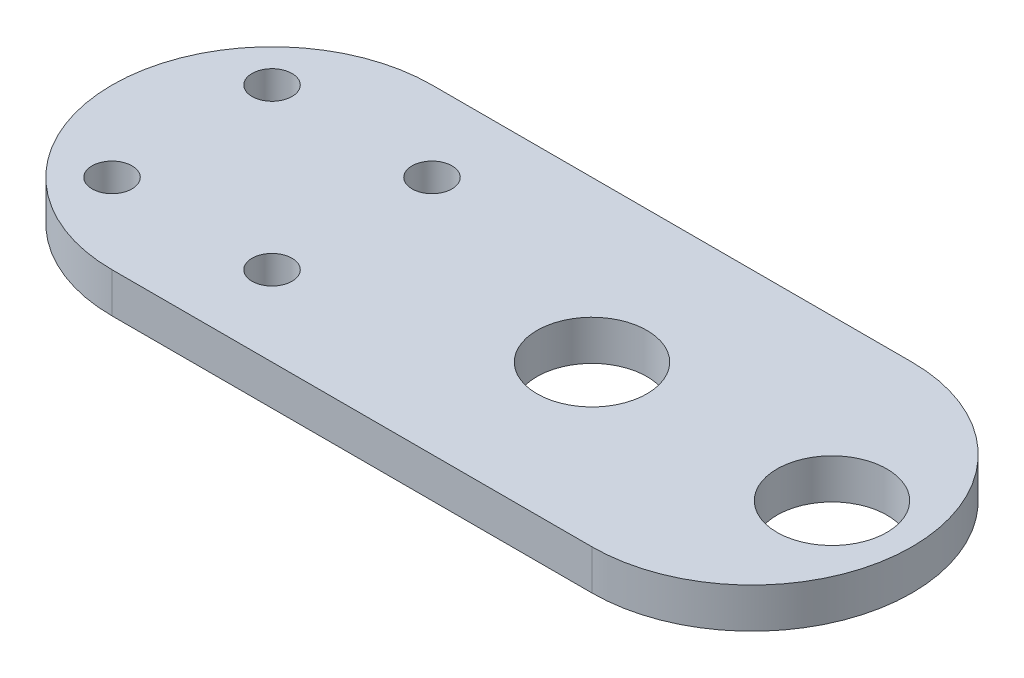
ISO-10303-21;
HEADER;
FILE_DESCRIPTION(('STEP AP214'),'2;1');
FILE_NAME('part.step','',(''),(''),'','','');
FILE_SCHEMA(('AUTOMOTIVE_DESIGN { 1 0 10303 214 1 1 1 1 }'));
ENDSEC;
DATA;
#1=APPLICATION_CONTEXT('core data for automotive mechanical design processes');
#2=APPLICATION_PROTOCOL_DEFINITION('international standard','automotive_design',2000,#1);
#3=PRODUCT_CONTEXT('',#1,'mechanical');
#4=PRODUCT('Part','Part','',(#3));
#5=PRODUCT_RELATED_PRODUCT_CATEGORY('part','',(#4));
#6=PRODUCT_DEFINITION_FORMATION('','',#4);
#7=PRODUCT_DEFINITION_CONTEXT('part definition',#1,'design');
#8=PRODUCT_DEFINITION('design','',#6,#7);
#9=PRODUCT_DEFINITION_SHAPE('','',#8);
#10=(LENGTH_UNIT() NAMED_UNIT(*) SI_UNIT(.MILLI.,.METRE.));
#11=(NAMED_UNIT(*) PLANE_ANGLE_UNIT() SI_UNIT($,.RADIAN.));
#12=(NAMED_UNIT(*) SI_UNIT($,.STERADIAN.) SOLID_ANGLE_UNIT());
#13=UNCERTAINTY_MEASURE_WITH_UNIT(LENGTH_MEASURE(1.E-05),#10,'distance_accuracy_value','');
#14=(GEOMETRIC_REPRESENTATION_CONTEXT(3) GLOBAL_UNCERTAINTY_ASSIGNED_CONTEXT((#13)) GLOBAL_UNIT_ASSIGNED_CONTEXT((#10,
#11,#12)) REPRESENTATION_CONTEXT('',''));
#15=CARTESIAN_POINT('',(0.,0.,0.));
#16=DIRECTION('',(0.,0.,1.));
#17=DIRECTION('',(1.,0.,0.));
#18=AXIS2_PLACEMENT_3D('',#15,#16,#17);
#19=CARTESIAN_POINT('',(101.6,6.35,-25.4));
#20=DIRECTION('',(0.,1.,0.));
#21=DIRECTION('',(0.,0.,1.));
#22=AXIS2_PLACEMENT_3D('',#19,#20,#21);
#23=PLANE('',#22);
#24=CARTESIAN_POINT('',(114.3,6.35,-25.4));
#25=DIRECTION('',(0.,1.,0.));
#26=DIRECTION('',(0.,0.,1.));
#27=AXIS2_PLACEMENT_3D('',#24,#25,#26);
#28=CIRCLE('',#27,8.72617);
#29=CARTESIAN_POINT('',(114.3,6.35,-16.67383));
#30=VERTEX_POINT('',#29);
#31=EDGE_CURVE('E133',#30,#30,#28,.T.);
#32=ORIENTED_EDGE('',*,*,#31,.F.);
#33=EDGE_LOOP('',(#32));
#34=FACE_BOUND('',#33,.T.);
#35=CARTESIAN_POINT('',(38.1,6.35,-12.7));
#36=DIRECTION('',(0.,1.,0.));
#37=DIRECTION('',(0.,0.,1.));
#38=AXIS2_PLACEMENT_3D('',#35,#36,#37);
#39=CIRCLE('',#38,3.175);
#40=CARTESIAN_POINT('',(38.1,6.35,-9.525));
#41=VERTEX_POINT('',#40);
#42=EDGE_CURVE('E121',#41,#41,#39,.T.);
#43=ORIENTED_EDGE('',*,*,#42,.F.);
#44=EDGE_LOOP('',(#43));
#45=FACE_BOUND('',#44,.T.);
#46=CARTESIAN_POINT('',(12.7,6.35,-38.1));
#47=DIRECTION('',(0.,1.,0.));
#48=DIRECTION('',(0.,0.,1.));
#49=AXIS2_PLACEMENT_3D('',#46,#47,#48);
#50=CIRCLE('',#49,3.175);
#51=CARTESIAN_POINT('',(12.7,6.35,-34.925));
#52=VERTEX_POINT('',#51);
#53=EDGE_CURVE('E100',#52,#52,#50,.T.);
#54=ORIENTED_EDGE('',*,*,#53,.F.);
#55=EDGE_LOOP('',(#54));
#56=FACE_BOUND('',#55,.T.);
#57=CARTESIAN_POINT('',(101.6,6.35,-25.4));
#58=DIRECTION('',(0.,1.,0.));
#59=DIRECTION('',(0.,0.,1.));
#60=AXIS2_PLACEMENT_3D('',#57,#58,#59);
#61=CIRCLE('',#60,25.4);
#62=CARTESIAN_POINT('',(101.6,6.35,0.));
#63=VERTEX_POINT('',#62);
#64=CARTESIAN_POINT('',(101.6,6.35,-50.8));
#65=VERTEX_POINT('',#64);
#66=EDGE_CURVE('E85',#63,#65,#61,.T.);
#67=ORIENTED_EDGE('',*,*,#66,.T.);
#68=DIRECTION('',(-1.,0.,0.));
#69=VECTOR('',#68,1.);
#70=CARTESIAN_POINT('',(25.4,6.35,-50.8));
#71=LINE('',#70,#69);
#72=CARTESIAN_POINT('',(25.4,6.35,-50.8));
#73=VERTEX_POINT('',#72);
#74=EDGE_CURVE('E80',#65,#73,#71,.T.);
#75=ORIENTED_EDGE('',*,*,#74,.T.);
#76=CARTESIAN_POINT('',(25.4,6.35,-25.4));
#77=DIRECTION('',(0.,1.,0.));
#78=DIRECTION('',(0.,0.,1.));
#79=AXIS2_PLACEMENT_3D('',#76,#77,#78);
#80=CIRCLE('',#79,25.4);
#81=CARTESIAN_POINT('',(25.4,6.35,0.));
#82=VERTEX_POINT('',#81);
#83=EDGE_CURVE('E83',#73,#82,#80,.T.);
#84=ORIENTED_EDGE('',*,*,#83,.T.);
#85=DIRECTION('',(1.,0.,0.));
#86=VECTOR('',#85,1.);
#87=CARTESIAN_POINT('',(25.4,6.35,0.));
#88=LINE('',#87,#86);
#89=EDGE_CURVE('E50',#82,#63,#88,.T.);
#90=ORIENTED_EDGE('',*,*,#89,.T.);
#91=EDGE_LOOP('',(#67,#75,#84,#90));
#92=FACE_BOUND('',#91,.T.);
#93=CARTESIAN_POINT('',(38.1,6.35,-38.1));
#94=DIRECTION('',(0.,1.,0.));
#95=DIRECTION('',(0.,0.,-1.));
#96=AXIS2_PLACEMENT_3D('',#93,#94,#95);
#97=CIRCLE('',#96,3.17500000000001);
#98=CARTESIAN_POINT('',(38.1,6.35,-41.275));
#99=VERTEX_POINT('',#98);
#100=EDGE_CURVE('E115',#99,#99,#97,.T.);
#101=ORIENTED_EDGE('',*,*,#100,.F.);
#102=EDGE_LOOP('',(#101));
#103=FACE_BOUND('',#102,.T.);
#104=CARTESIAN_POINT('',(12.7,6.35,-12.7));
#105=DIRECTION('',(0.,1.,0.));
#106=DIRECTION('',(0.,0.,-1.));
#107=AXIS2_PLACEMENT_3D('',#104,#105,#106);
#108=CIRCLE('',#107,3.175);
#109=CARTESIAN_POINT('',(12.7,6.35,-15.875));
#110=VERTEX_POINT('',#109);
#111=EDGE_CURVE('E127',#110,#110,#108,.T.);
#112=ORIENTED_EDGE('',*,*,#111,.F.);
#113=EDGE_LOOP('',(#112));
#114=FACE_BOUND('',#113,.T.);
#115=CARTESIAN_POINT('',(76.2,6.35,-25.4));
#116=DIRECTION('',(0.,1.,0.));
#117=DIRECTION('',(0.,0.,1.));
#118=AXIS2_PLACEMENT_3D('',#115,#116,#117);
#119=CIRCLE('',#118,8.72617);
#120=CARTESIAN_POINT('',(76.2,6.35,-16.67383));
#121=VERTEX_POINT('',#120);
#122=EDGE_CURVE('E139',#121,#121,#119,.T.);
#123=ORIENTED_EDGE('',*,*,#122,.F.);
#124=EDGE_LOOP('',(#123));
#125=FACE_BOUND('',#124,.T.);
#126=ADVANCED_FACE('F33',(#34,#45,#56,#92,#103,#114,#125),#23,.T.);
#127=CARTESIAN_POINT('',(101.6,0.,-25.4));
#128=DIRECTION('',(0.,1.,0.));
#129=DIRECTION('',(0.,0.,1.));
#130=AXIS2_PLACEMENT_3D('',#127,#128,#129);
#131=PLANE('',#130);
#132=CARTESIAN_POINT('',(114.3,0.,-25.4));
#133=DIRECTION('',(0.,1.,0.));
#134=DIRECTION('',(0.,0.,1.));
#135=AXIS2_PLACEMENT_3D('',#132,#133,#134);
#136=CIRCLE('',#135,8.72617);
#137=CARTESIAN_POINT('',(114.3,0.,-16.67383));
#138=VERTEX_POINT('',#137);
#139=EDGE_CURVE('E136',#138,#138,#136,.T.);
#140=ORIENTED_EDGE('',*,*,#139,.T.);
#141=EDGE_LOOP('',(#140));
#142=FACE_BOUND('',#141,.T.);
#143=CARTESIAN_POINT('',(38.1,0.,-12.7));
#144=DIRECTION('',(0.,1.,0.));
#145=DIRECTION('',(0.,0.,1.));
#146=AXIS2_PLACEMENT_3D('',#143,#144,#145);
#147=CIRCLE('',#146,3.175);
#148=CARTESIAN_POINT('',(38.1,0.,-9.525));
#149=VERTEX_POINT('',#148);
#150=EDGE_CURVE('E124',#149,#149,#147,.T.);
#151=ORIENTED_EDGE('',*,*,#150,.T.);
#152=EDGE_LOOP('',(#151));
#153=FACE_BOUND('',#152,.T.);
#154=CARTESIAN_POINT('',(12.7,0.,-38.1));
#155=DIRECTION('',(0.,1.,0.));
#156=DIRECTION('',(0.,0.,1.));
#157=AXIS2_PLACEMENT_3D('',#154,#155,#156);
#158=CIRCLE('',#157,3.175);
#159=CARTESIAN_POINT('',(12.7,0.,-34.925));
#160=VERTEX_POINT('',#159);
#161=EDGE_CURVE('E112',#160,#160,#158,.T.);
#162=ORIENTED_EDGE('',*,*,#161,.T.);
#163=EDGE_LOOP('',(#162));
#164=FACE_BOUND('',#163,.T.);
#165=CARTESIAN_POINT('',(101.6,0.,-25.4));
#166=DIRECTION('',(0.,1.,0.));
#167=DIRECTION('',(0.,0.,1.));
#168=AXIS2_PLACEMENT_3D('',#165,#166,#167);
#169=CIRCLE('',#168,25.4);
#170=CARTESIAN_POINT('',(101.6,0.,0.));
#171=VERTEX_POINT('',#170);
#172=CARTESIAN_POINT('',(101.6,0.,-50.8));
#173=VERTEX_POINT('',#172);
#174=EDGE_CURVE('E97',#171,#173,#169,.T.);
#175=ORIENTED_EDGE('',*,*,#174,.F.);
#176=DIRECTION('',(1.,0.,0.));
#177=VECTOR('',#176,1.);
#178=CARTESIAN_POINT('',(25.4,0.,0.));
#179=LINE('',#178,#177);
#180=CARTESIAN_POINT('',(25.4,0.,0.));
#181=VERTEX_POINT('',#180);
#182=EDGE_CURVE('E73',#181,#171,#179,.T.);
#183=ORIENTED_EDGE('',*,*,#182,.F.);
#184=CARTESIAN_POINT('',(25.4,0.,-25.4));
#185=DIRECTION('',(0.,1.,0.));
#186=DIRECTION('',(0.,0.,1.));
#187=AXIS2_PLACEMENT_3D('',#184,#185,#186);
#188=CIRCLE('',#187,25.4);
#189=CARTESIAN_POINT('',(25.4,0.,-50.8));
#190=VERTEX_POINT('',#189);
#191=EDGE_CURVE('E67',#190,#181,#188,.T.);
#192=ORIENTED_EDGE('',*,*,#191,.F.);
#193=DIRECTION('',(-1.,0.,0.));
#194=VECTOR('',#193,1.);
#195=CARTESIAN_POINT('',(25.4,0.,-50.8));
#196=LINE('',#195,#194);
#197=EDGE_CURVE('E89',#173,#190,#196,.T.);
#198=ORIENTED_EDGE('',*,*,#197,.F.);
#199=EDGE_LOOP('',(#175,#183,#192,#198));
#200=FACE_BOUND('',#199,.T.);
#201=CARTESIAN_POINT('',(38.1,0.,-38.1));
#202=DIRECTION('',(0.,1.,0.));
#203=DIRECTION('',(0.,0.,-1.));
#204=AXIS2_PLACEMENT_3D('',#201,#202,#203);
#205=CIRCLE('',#204,3.17500000000001);
#206=CARTESIAN_POINT('',(38.1,0.,-41.275));
#207=VERTEX_POINT('',#206);
#208=EDGE_CURVE('E118',#207,#207,#205,.T.);
#209=ORIENTED_EDGE('',*,*,#208,.T.);
#210=EDGE_LOOP('',(#209));
#211=FACE_BOUND('',#210,.T.);
#212=CARTESIAN_POINT('',(12.7,0.,-12.7));
#213=DIRECTION('',(0.,1.,0.));
#214=DIRECTION('',(0.,0.,-1.));
#215=AXIS2_PLACEMENT_3D('',#212,#213,#214);
#216=CIRCLE('',#215,3.175);
#217=CARTESIAN_POINT('',(12.7,0.,-15.875));
#218=VERTEX_POINT('',#217);
#219=EDGE_CURVE('E130',#218,#218,#216,.T.);
#220=ORIENTED_EDGE('',*,*,#219,.T.);
#221=EDGE_LOOP('',(#220));
#222=FACE_BOUND('',#221,.T.);
#223=CARTESIAN_POINT('',(76.2,0.,-25.4));
#224=DIRECTION('',(0.,1.,0.));
#225=DIRECTION('',(0.,0.,1.));
#226=AXIS2_PLACEMENT_3D('',#223,#224,#225);
#227=CIRCLE('',#226,8.72617);
#228=CARTESIAN_POINT('',(76.2,0.,-16.67383));
#229=VERTEX_POINT('',#228);
#230=EDGE_CURVE('E142',#229,#229,#227,.T.);
#231=ORIENTED_EDGE('',*,*,#230,.T.);
#232=EDGE_LOOP('',(#231));
#233=FACE_BOUND('',#232,.T.);
#234=ADVANCED_FACE('F108',(#142,#153,#164,#200,#211,#222,#233),#131,.F.);
#235=CARTESIAN_POINT('',(101.6,6.35,-25.4));
#236=DIRECTION('',(0.,-1.,0.));
#237=DIRECTION('',(0.,0.,-1.));
#238=AXIS2_PLACEMENT_3D('',#235,#236,#237);
#239=CYLINDRICAL_SURFACE('',#238,25.4);
#240=ORIENTED_EDGE('',*,*,#174,.T.);
#241=DIRECTION('',(0.,-1.,0.));
#242=VECTOR('',#241,1.);
#243=CARTESIAN_POINT('',(101.6,6.35,-50.8));
#244=LINE('',#243,#242);
#245=EDGE_CURVE('E11',#65,#173,#244,.T.);
#246=ORIENTED_EDGE('',*,*,#245,.F.);
#247=ORIENTED_EDGE('',*,*,#66,.F.);
#248=DIRECTION('',(0.,-1.,0.));
#249=VECTOR('',#248,1.);
#250=CARTESIAN_POINT('',(101.6,6.35,0.));
#251=LINE('',#250,#249);
#252=EDGE_CURVE('E93',#63,#171,#251,.T.);
#253=ORIENTED_EDGE('',*,*,#252,.T.);
#254=EDGE_LOOP('',(#240,#246,#247,#253));
#255=FACE_BOUND('',#254,.T.);
#256=ADVANCED_FACE('F35',(#255),#239,.T.);
#257=CARTESIAN_POINT('',(25.4,6.35,-50.8));
#258=DIRECTION('',(0.,0.,1.));
#259=DIRECTION('',(1.,0.,0.));
#260=AXIS2_PLACEMENT_3D('',#257,#258,#259);
#261=PLANE('',#260);
#262=ORIENTED_EDGE('',*,*,#197,.T.);
#263=DIRECTION('',(0.,-1.,0.));
#264=VECTOR('',#263,1.);
#265=CARTESIAN_POINT('',(25.4,6.35,-50.8));
#266=LINE('',#265,#264);
#267=EDGE_CURVE('E42',#73,#190,#266,.T.);
#268=ORIENTED_EDGE('',*,*,#267,.F.);
#269=ORIENTED_EDGE('',*,*,#74,.F.);
#270=ORIENTED_EDGE('',*,*,#245,.T.);
#271=EDGE_LOOP('',(#262,#268,#269,#270));
#272=FACE_BOUND('',#271,.T.);
#273=ADVANCED_FACE('F88',(#272),#261,.F.);
#274=CARTESIAN_POINT('',(25.4,6.35,-25.4));
#275=DIRECTION('',(0.,-1.,0.));
#276=DIRECTION('',(0.,0.,-1.));
#277=AXIS2_PLACEMENT_3D('',#274,#275,#276);
#278=CYLINDRICAL_SURFACE('',#277,25.4);
#279=ORIENTED_EDGE('',*,*,#191,.T.);
#280=DIRECTION('',(0.,-1.,0.));
#281=VECTOR('',#280,1.);
#282=CARTESIAN_POINT('',(25.4,6.35,0.));
#283=LINE('',#282,#281);
#284=EDGE_CURVE('E90',#82,#181,#283,.T.);
#285=ORIENTED_EDGE('',*,*,#284,.F.);
#286=ORIENTED_EDGE('',*,*,#83,.F.);
#287=ORIENTED_EDGE('',*,*,#267,.T.);
#288=EDGE_LOOP('',(#279,#285,#286,#287));
#289=FACE_BOUND('',#288,.T.);
#290=ADVANCED_FACE('F91',(#289),#278,.T.);
#291=CARTESIAN_POINT('',(25.4,6.35,0.));
#292=DIRECTION('',(0.,0.,-1.));
#293=DIRECTION('',(-1.,0.,0.));
#294=AXIS2_PLACEMENT_3D('',#291,#292,#293);
#295=PLANE('',#294);
#296=ORIENTED_EDGE('',*,*,#182,.T.);
#297=ORIENTED_EDGE('',*,*,#252,.F.);
#298=ORIENTED_EDGE('',*,*,#89,.F.);
#299=ORIENTED_EDGE('',*,*,#284,.T.);
#300=EDGE_LOOP('',(#296,#297,#298,#299));
#301=FACE_BOUND('',#300,.T.);
#302=ADVANCED_FACE('F105',(#301),#295,.F.);
#303=CARTESIAN_POINT('',(12.7,6.35,-38.1));
#304=DIRECTION('',(0.,-1.,0.));
#305=DIRECTION('',(0.,0.,-1.));
#306=AXIS2_PLACEMENT_3D('',#303,#304,#305);
#307=CYLINDRICAL_SURFACE('',#306,3.175);
#308=ORIENTED_EDGE('',*,*,#53,.T.);
#309=EDGE_LOOP('',(#308));
#310=FACE_BOUND('',#309,.T.);
#311=ORIENTED_EDGE('',*,*,#161,.F.);
#312=EDGE_LOOP('',(#311));
#313=FACE_BOUND('',#312,.T.);
#314=ADVANCED_FACE('F162',(#310,#313),#307,.F.);
#315=CARTESIAN_POINT('',(38.1,6.35,-38.1));
#316=DIRECTION('',(0.,-1.,0.));
#317=DIRECTION('',(0.,0.,-1.));
#318=AXIS2_PLACEMENT_3D('',#315,#316,#317);
#319=CYLINDRICAL_SURFACE('',#318,3.17500000000001);
#320=ORIENTED_EDGE('',*,*,#100,.T.);
#321=EDGE_LOOP('',(#320));
#322=FACE_BOUND('',#321,.T.);
#323=ORIENTED_EDGE('',*,*,#208,.F.);
#324=EDGE_LOOP('',(#323));
#325=FACE_BOUND('',#324,.T.);
#326=ADVANCED_FACE('F208',(#322,#325),#319,.F.);
#327=CARTESIAN_POINT('',(38.1,6.35,-12.7));
#328=DIRECTION('',(0.,-1.,0.));
#329=DIRECTION('',(0.,0.,-1.));
#330=AXIS2_PLACEMENT_3D('',#327,#328,#329);
#331=CYLINDRICAL_SURFACE('',#330,3.175);
#332=ORIENTED_EDGE('',*,*,#42,.T.);
#333=EDGE_LOOP('',(#332));
#334=FACE_BOUND('',#333,.T.);
#335=ORIENTED_EDGE('',*,*,#150,.F.);
#336=EDGE_LOOP('',(#335));
#337=FACE_BOUND('',#336,.T.);
#338=ADVANCED_FACE('F216',(#334,#337),#331,.F.);
#339=CARTESIAN_POINT('',(12.7,6.35,-12.7));
#340=DIRECTION('',(0.,-1.,0.));
#341=DIRECTION('',(0.,0.,-1.));
#342=AXIS2_PLACEMENT_3D('',#339,#340,#341);
#343=CYLINDRICAL_SURFACE('',#342,3.175);
#344=ORIENTED_EDGE('',*,*,#111,.T.);
#345=EDGE_LOOP('',(#344));
#346=FACE_BOUND('',#345,.T.);
#347=ORIENTED_EDGE('',*,*,#219,.F.);
#348=EDGE_LOOP('',(#347));
#349=FACE_BOUND('',#348,.T.);
#350=ADVANCED_FACE('F224',(#346,#349),#343,.F.);
#351=CARTESIAN_POINT('',(114.3,6.35,-25.4));
#352=DIRECTION('',(0.,-1.,0.));
#353=DIRECTION('',(0.,0.,-1.));
#354=AXIS2_PLACEMENT_3D('',#351,#352,#353);
#355=CYLINDRICAL_SURFACE('',#354,8.72617);
#356=ORIENTED_EDGE('',*,*,#31,.T.);
#357=EDGE_LOOP('',(#356));
#358=FACE_BOUND('',#357,.T.);
#359=ORIENTED_EDGE('',*,*,#139,.F.);
#360=EDGE_LOOP('',(#359));
#361=FACE_BOUND('',#360,.T.);
#362=ADVANCED_FACE('F233',(#358,#361),#355,.F.);
#363=CARTESIAN_POINT('',(76.2,6.35,-25.4));
#364=DIRECTION('',(0.,-1.,0.));
#365=DIRECTION('',(0.,0.,-1.));
#366=AXIS2_PLACEMENT_3D('',#363,#364,#365);
#367=CYLINDRICAL_SURFACE('',#366,8.72617);
#368=ORIENTED_EDGE('',*,*,#122,.T.);
#369=EDGE_LOOP('',(#368));
#370=FACE_BOUND('',#369,.T.);
#371=ORIENTED_EDGE('',*,*,#230,.F.);
#372=EDGE_LOOP('',(#371));
#373=FACE_BOUND('',#372,.T.);
#374=ADVANCED_FACE('F148',(#370,#373),#367,.F.);
#375=CLOSED_SHELL('',(#126,#234,#256,#273,#290,#302,#314,#326,#338,#350,#362,#374));
#376=MANIFOLD_SOLID_BREP('B2',#375);
#377=ADVANCED_BREP_SHAPE_REPRESENTATION('',(#18,#376),#14);
#378=SHAPE_DEFINITION_REPRESENTATION(#9,#377);
ENDSEC;
END-ISO-10303-21;
